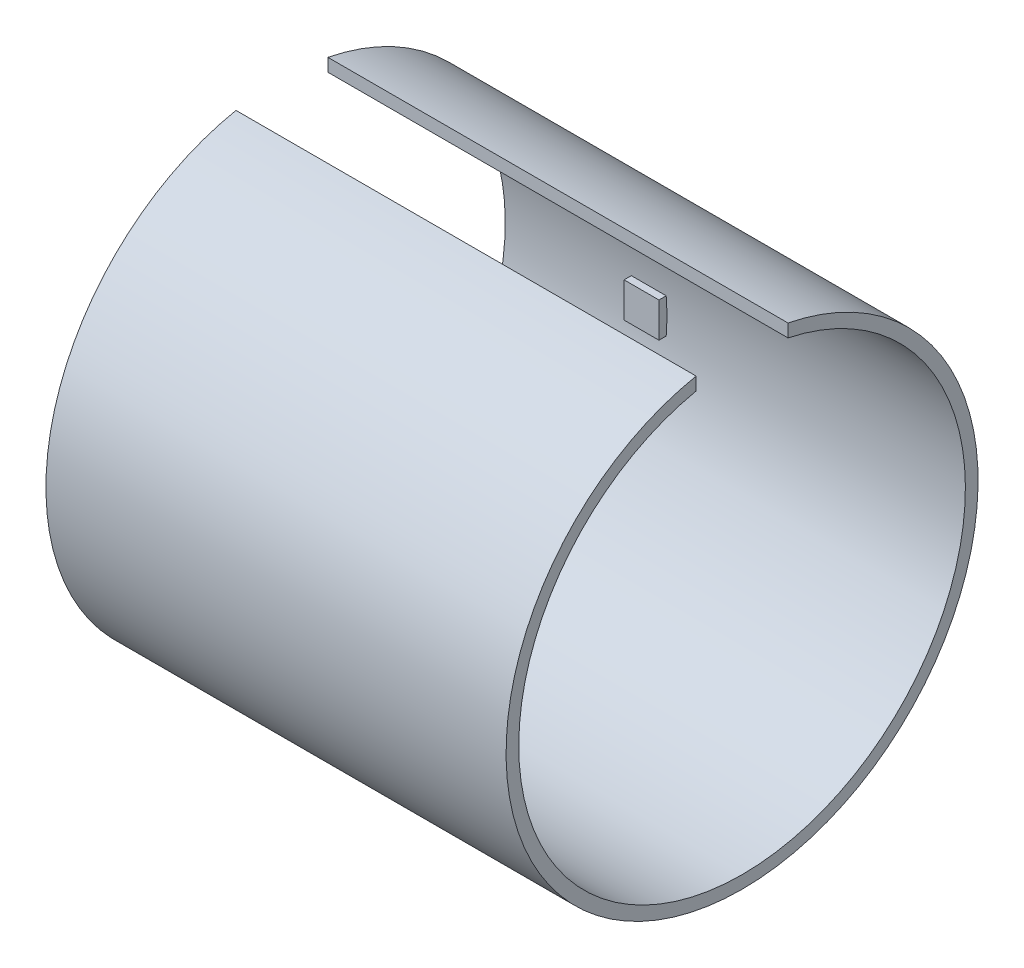
ISO-10303-21;
HEADER;
FILE_DESCRIPTION(('STEP AP214'),'2;1');
FILE_NAME('part.step','',(''),(''),'','','');
FILE_SCHEMA(('AUTOMOTIVE_DESIGN { 1 0 10303 214 1 1 1 1 }'));
ENDSEC;
DATA;
#1=APPLICATION_CONTEXT('core data for automotive mechanical design processes');
#2=APPLICATION_PROTOCOL_DEFINITION('international standard','automotive_design',2000,#1);
#3=PRODUCT_CONTEXT('',#1,'mechanical');
#4=PRODUCT('Part','Part','',(#3));
#5=PRODUCT_RELATED_PRODUCT_CATEGORY('part','',(#4));
#6=PRODUCT_DEFINITION_FORMATION('','',#4);
#7=PRODUCT_DEFINITION_CONTEXT('part definition',#1,'design');
#8=PRODUCT_DEFINITION('design','',#6,#7);
#9=PRODUCT_DEFINITION_SHAPE('','',#8);
#10=(LENGTH_UNIT() NAMED_UNIT(*) SI_UNIT(.MILLI.,.METRE.));
#11=(NAMED_UNIT(*) PLANE_ANGLE_UNIT() SI_UNIT($,.RADIAN.));
#12=(NAMED_UNIT(*) SI_UNIT($,.STERADIAN.) SOLID_ANGLE_UNIT());
#13=UNCERTAINTY_MEASURE_WITH_UNIT(LENGTH_MEASURE(1.E-05),#10,'distance_accuracy_value','');
#14=(GEOMETRIC_REPRESENTATION_CONTEXT(3) GLOBAL_UNCERTAINTY_ASSIGNED_CONTEXT((#13)) GLOBAL_UNIT_ASSIGNED_CONTEXT((#10,
#11,#12)) REPRESENTATION_CONTEXT('',''));
#15=CARTESIAN_POINT('',(0.,0.,0.));
#16=DIRECTION('',(0.,0.,1.));
#17=DIRECTION('',(1.,0.,0.));
#18=AXIS2_PLACEMENT_3D('',#15,#16,#17);
#19=CARTESIAN_POINT('',(10.16,1.397,-17.265000014));
#20=DIRECTION('',(1.,0.,0.));
#21=DIRECTION('',(0.,0.,-1.));
#22=AXIS2_PLACEMENT_3D('',#19,#20,#21);
#23=PLANE('',#22);
#24=CARTESIAN_POINT('',(10.16,0.,0.));
#25=DIRECTION('',(-1.,0.,0.));
#26=DIRECTION('',(0.,0.,1.));
#27=AXIS2_PLACEMENT_3D('',#24,#25,#26);
#28=CIRCLE('',#27,17.9);
#29=CARTESIAN_POINT('',(10.16,-1.397,-17.8454025171751));
#30=VERTEX_POINT('',#29);
#31=CARTESIAN_POINT('',(10.16,1.397,-17.8454025171751));
#32=VERTEX_POINT('',#31);
#33=EDGE_CURVE('E20',#30,#32,#28,.F.);
#34=ORIENTED_EDGE('',*,*,#33,.F.);
#35=DIRECTION('',(0.,0.,-1.));
#36=VECTOR('',#35,1.);
#37=CARTESIAN_POINT('',(10.16,-1.397,-17.265000014));
#38=LINE('',#37,#36);
#39=CARTESIAN_POINT('',(10.16,-1.397,-17.265000014));
#40=VERTEX_POINT('',#39);
#41=EDGE_CURVE('E106',#40,#30,#38,.T.);
#42=ORIENTED_EDGE('',*,*,#41,.F.);
#43=DIRECTION('',(0.,1.,0.));
#44=VECTOR('',#43,1.);
#45=CARTESIAN_POINT('',(10.16,-1.397,-17.265000014));
#46=LINE('',#45,#44);
#47=CARTESIAN_POINT('',(10.16,1.397,-17.265000014));
#48=VERTEX_POINT('',#47);
#49=EDGE_CURVE('E138',#48,#40,#46,.F.);
#50=ORIENTED_EDGE('',*,*,#49,.F.);
#51=DIRECTION('',(0.,0.,-1.));
#52=VECTOR('',#51,1.);
#53=CARTESIAN_POINT('',(10.16,1.397,-17.265000014));
#54=LINE('',#53,#52);
#55=EDGE_CURVE('E108',#32,#48,#54,.F.);
#56=ORIENTED_EDGE('',*,*,#55,.F.);
#57=EDGE_LOOP('',(#34,#42,#50,#56));
#58=FACE_BOUND('',#57,.T.);
#59=ADVANCED_FACE('F17',(#58),#23,.F.);
#60=CARTESIAN_POINT('',(12.954,-1.397,-17.265000014));
#61=DIRECTION('',(-1.,0.,0.));
#62=DIRECTION('',(0.,0.,1.));
#63=AXIS2_PLACEMENT_3D('',#60,#61,#62);
#64=PLANE('',#63);
#65=CARTESIAN_POINT('',(12.954,0.,0.));
#66=DIRECTION('',(-1.,0.,0.));
#67=DIRECTION('',(0.,0.,1.));
#68=AXIS2_PLACEMENT_3D('',#65,#66,#67);
#69=CIRCLE('',#68,17.9);
#70=CARTESIAN_POINT('',(12.954,1.397,-17.8454025171751));
#71=VERTEX_POINT('',#70);
#72=CARTESIAN_POINT('',(12.954,-1.397,-17.8454025171751));
#73=VERTEX_POINT('',#72);
#74=EDGE_CURVE('E121',#71,#73,#69,.T.);
#75=ORIENTED_EDGE('',*,*,#74,.F.);
#76=DIRECTION('',(0.,0.,1.));
#77=VECTOR('',#76,1.);
#78=CARTESIAN_POINT('',(12.954,1.397,-17.265000014));
#79=LINE('',#78,#77);
#80=CARTESIAN_POINT('',(12.954,1.397,-17.265000014));
#81=VERTEX_POINT('',#80);
#82=EDGE_CURVE('E109',#81,#71,#79,.F.);
#83=ORIENTED_EDGE('',*,*,#82,.F.);
#84=DIRECTION('',(0.,1.,0.));
#85=VECTOR('',#84,1.);
#86=CARTESIAN_POINT('',(12.954,-1.397,-17.265000014));
#87=LINE('',#86,#85);
#88=CARTESIAN_POINT('',(12.954,-1.397,-17.265000014));
#89=VERTEX_POINT('',#88);
#90=EDGE_CURVE('E134',#89,#81,#87,.T.);
#91=ORIENTED_EDGE('',*,*,#90,.F.);
#92=DIRECTION('',(0.,0.,1.));
#93=VECTOR('',#92,1.);
#94=CARTESIAN_POINT('',(12.954,-1.397,-17.265000014));
#95=LINE('',#94,#93);
#96=EDGE_CURVE('E150',#73,#89,#95,.T.);
#97=ORIENTED_EDGE('',*,*,#96,.F.);
#98=EDGE_LOOP('',(#75,#83,#91,#97));
#99=FACE_BOUND('',#98,.T.);
#100=ADVANCED_FACE('F186',(#99),#64,.F.);
#101=CARTESIAN_POINT('',(10.16,-1.397,-17.265000014));
#102=DIRECTION('',(0.,0.,1.));
#103=DIRECTION('',(1.,0.,0.));
#104=AXIS2_PLACEMENT_3D('',#101,#102,#103);
#105=PLANE('',#104);
#106=ORIENTED_EDGE('',*,*,#90,.T.);
#107=DIRECTION('',(1.,0.,0.));
#108=VECTOR('',#107,1.);
#109=CARTESIAN_POINT('',(12.954,1.397,-17.265000014));
#110=LINE('',#109,#108);
#111=EDGE_CURVE('E137',#81,#48,#110,.F.);
#112=ORIENTED_EDGE('',*,*,#111,.T.);
#113=ORIENTED_EDGE('',*,*,#49,.T.);
#114=DIRECTION('',(-1.,0.,0.));
#115=VECTOR('',#114,1.);
#116=CARTESIAN_POINT('',(10.16,-1.397,-17.265000014));
#117=LINE('',#116,#115);
#118=EDGE_CURVE('E117',#40,#89,#117,.F.);
#119=ORIENTED_EDGE('',*,*,#118,.T.);
#120=EDGE_LOOP('',(#106,#112,#113,#119));
#121=FACE_BOUND('',#120,.T.);
#122=ADVANCED_FACE('F183',(#121),#105,.T.);
#123=CARTESIAN_POINT('',(12.954,1.397,-17.265000014));
#124=DIRECTION('',(0.,-1.,0.));
#125=DIRECTION('',(1.,0.,0.));
#126=AXIS2_PLACEMENT_3D('',#123,#124,#125);
#127=PLANE('',#126);
#128=DIRECTION('',(-1.,0.,0.));
#129=VECTOR('',#128,1.);
#130=CARTESIAN_POINT('',(36.8808,1.397,-17.8454025171751));
#131=LINE('',#130,#129);
#132=EDGE_CURVE('E123',#71,#32,#131,.T.);
#133=ORIENTED_EDGE('',*,*,#132,.T.);
#134=ORIENTED_EDGE('',*,*,#55,.T.);
#135=ORIENTED_EDGE('',*,*,#111,.F.);
#136=ORIENTED_EDGE('',*,*,#82,.T.);
#137=EDGE_LOOP('',(#133,#134,#135,#136));
#138=FACE_BOUND('',#137,.T.);
#139=ADVANCED_FACE('F181',(#138),#127,.F.);
#140=CARTESIAN_POINT('',(10.16,-1.397,-17.265000014));
#141=DIRECTION('',(0.,1.,0.));
#142=DIRECTION('',(-1.,0.,0.));
#143=AXIS2_PLACEMENT_3D('',#140,#141,#142);
#144=PLANE('',#143);
#145=DIRECTION('',(-1.,0.,0.));
#146=VECTOR('',#145,1.);
#147=CARTESIAN_POINT('',(36.8808,-1.397,-17.8454025171751));
#148=LINE('',#147,#146);
#149=EDGE_CURVE('E114',#30,#73,#148,.F.);
#150=ORIENTED_EDGE('',*,*,#149,.T.);
#151=ORIENTED_EDGE('',*,*,#96,.T.);
#152=ORIENTED_EDGE('',*,*,#118,.F.);
#153=ORIENTED_EDGE('',*,*,#41,.T.);
#154=EDGE_LOOP('',(#150,#151,#152,#153));
#155=FACE_BOUND('',#154,.T.);
#156=ADVANCED_FACE('F113',(#155),#144,.F.);
#157=CARTESIAN_POINT('',(12.954,-1.397,-18.281000014));
#158=DIRECTION('',(-1.,0.,0.));
#159=DIRECTION('',(0.,0.,1.));
#160=AXIS2_PLACEMENT_3D('',#157,#158,#159);
#161=PLANE('',#160);
#162=DIRECTION('',(0.,0.,1.));
#163=VECTOR('',#162,1.);
#164=CARTESIAN_POINT('',(12.954,-1.397,-18.281000014));
#165=LINE('',#164,#163);
#166=CARTESIAN_POINT('',(12.954,-1.397,-18.8643432697775));
#167=VERTEX_POINT('',#166);
#168=CARTESIAN_POINT('',(12.954,-1.397,-18.281000014));
#169=VERTEX_POINT('',#168);
#170=EDGE_CURVE('E35',#167,#169,#165,.T.);
#171=ORIENTED_EDGE('',*,*,#170,.T.);
#172=DIRECTION('',(0.,1.,0.));
#173=VECTOR('',#172,1.);
#174=CARTESIAN_POINT('',(12.954,1.397,-18.281000014));
#175=LINE('',#174,#173);
#176=CARTESIAN_POINT('',(12.954,1.397,-18.281000014));
#177=VERTEX_POINT('',#176);
#178=EDGE_CURVE('E382',#177,#169,#175,.F.);
#179=ORIENTED_EDGE('',*,*,#178,.F.);
#180=DIRECTION('',(0.,0.,1.));
#181=VECTOR('',#180,1.);
#182=CARTESIAN_POINT('',(12.954,1.397,-18.281000014));
#183=LINE('',#182,#181);
#184=CARTESIAN_POINT('',(12.954,1.397,-18.8643432697775));
#185=VERTEX_POINT('',#184);
#186=EDGE_CURVE('E126',#185,#177,#183,.T.);
#187=ORIENTED_EDGE('',*,*,#186,.F.);
#188=CARTESIAN_POINT('',(12.954,0.,0.));
#189=DIRECTION('',(-1.,0.,0.));
#190=DIRECTION('',(0.,0.,1.));
#191=AXIS2_PLACEMENT_3D('',#188,#189,#190);
#192=CIRCLE('',#191,18.916);
#193=EDGE_CURVE('E142',#185,#167,#192,.T.);
#194=ORIENTED_EDGE('',*,*,#193,.T.);
#195=EDGE_LOOP('',(#171,#179,#187,#194));
#196=FACE_BOUND('',#195,.T.);
#197=ADVANCED_FACE('F236',(#196),#161,.T.);
#198=CARTESIAN_POINT('',(10.16,-1.397,-18.281000014));
#199=DIRECTION('',(1.,0.,0.));
#200=DIRECTION('',(0.,0.,-1.));
#201=AXIS2_PLACEMENT_3D('',#198,#199,#200);
#202=PLANE('',#201);
#203=DIRECTION('',(0.,1.,0.));
#204=VECTOR('',#203,1.);
#205=CARTESIAN_POINT('',(10.16,1.397,-18.281000014));
#206=LINE('',#205,#204);
#207=CARTESIAN_POINT('',(10.16,-1.397,-18.281000014));
#208=VERTEX_POINT('',#207);
#209=CARTESIAN_POINT('',(10.16,1.397,-18.281000014));
#210=VERTEX_POINT('',#209);
#211=EDGE_CURVE('E375',#208,#210,#206,.T.);
#212=ORIENTED_EDGE('',*,*,#211,.F.);
#213=DIRECTION('',(0.,0.,-1.));
#214=VECTOR('',#213,1.);
#215=CARTESIAN_POINT('',(10.16,-1.397,-18.281000014));
#216=LINE('',#215,#214);
#217=CARTESIAN_POINT('',(10.16,-1.397,-18.8643432697775));
#218=VERTEX_POINT('',#217);
#219=EDGE_CURVE('E169',#208,#218,#216,.T.);
#220=ORIENTED_EDGE('',*,*,#219,.T.);
#221=CARTESIAN_POINT('',(10.16,0.,0.));
#222=DIRECTION('',(-1.,0.,0.));
#223=DIRECTION('',(0.,0.,1.));
#224=AXIS2_PLACEMENT_3D('',#221,#222,#223);
#225=CIRCLE('',#224,18.916);
#226=CARTESIAN_POINT('',(10.16,1.397,-18.8643432697775));
#227=VERTEX_POINT('',#226);
#228=EDGE_CURVE('E167',#218,#227,#225,.F.);
#229=ORIENTED_EDGE('',*,*,#228,.T.);
#230=DIRECTION('',(0.,0.,1.));
#231=VECTOR('',#230,1.);
#232=CARTESIAN_POINT('',(10.16,1.397,-18.281000014));
#233=LINE('',#232,#231);
#234=EDGE_CURVE('E378',#210,#227,#233,.F.);
#235=ORIENTED_EDGE('',*,*,#234,.F.);
#236=EDGE_LOOP('',(#212,#220,#229,#235));
#237=FACE_BOUND('',#236,.T.);
#238=ADVANCED_FACE('F232',(#237),#202,.T.);
#239=CARTESIAN_POINT('',(36.8808,17.5170063367003,3.683));
#240=DIRECTION('',(0.,0.,1.));
#241=DIRECTION('',(1.,0.,0.));
#242=AXIS2_PLACEMENT_3D('',#239,#240,#241);
#243=PLANE('',#242);
#244=DIRECTION('',(-1.,0.,0.));
#245=VECTOR('',#244,1.);
#246=CARTESIAN_POINT('',(36.8808,18.5539905950176,3.683));
#247=LINE('',#246,#245);
#248=CARTESIAN_POINT('',(36.8808,18.5539905950176,3.683));
#249=VERTEX_POINT('',#248);
#250=CARTESIAN_POINT('',(0.,18.5539905950176,3.683));
#251=VERTEX_POINT('',#250);
#252=EDGE_CURVE('E418',#249,#251,#247,.T.);
#253=ORIENTED_EDGE('',*,*,#252,.F.);
#254=DIRECTION('',(0.,1.,0.));
#255=VECTOR('',#254,1.);
#256=CARTESIAN_POINT('',(36.8808,0.,3.683));
#257=LINE('',#256,#255);
#258=CARTESIAN_POINT('',(36.8808,17.5170063367003,3.683));
#259=VERTEX_POINT('',#258);
#260=EDGE_CURVE('E165',#259,#249,#257,.T.);
#261=ORIENTED_EDGE('',*,*,#260,.F.);
#262=DIRECTION('',(-1.,0.,0.));
#263=VECTOR('',#262,1.);
#264=CARTESIAN_POINT('',(36.8808,17.5170063367003,3.683));
#265=LINE('',#264,#263);
#266=CARTESIAN_POINT('',(0.,17.5170063367003,3.683));
#267=VERTEX_POINT('',#266);
#268=EDGE_CURVE('E122',#259,#267,#265,.T.);
#269=ORIENTED_EDGE('',*,*,#268,.T.);
#270=DIRECTION('',(0.,1.,0.));
#271=VECTOR('',#270,1.);
#272=CARTESIAN_POINT('',(0.,17.5170063367003,3.683));
#273=LINE('',#272,#271);
#274=EDGE_CURVE('E128',#251,#267,#273,.F.);
#275=ORIENTED_EDGE('',*,*,#274,.F.);
#276=EDGE_LOOP('',(#253,#261,#269,#275));
#277=FACE_BOUND('',#276,.T.);
#278=ADVANCED_FACE('F229',(#277),#243,.F.);
#279=CARTESIAN_POINT('',(36.8808,0.,0.));
#280=DIRECTION('',(-1.,0.,0.));
#281=DIRECTION('',(0.,0.,1.));
#282=AXIS2_PLACEMENT_3D('',#279,#280,#281);
#283=CYLINDRICAL_SURFACE('',#282,17.9);
#284=ORIENTED_EDGE('',*,*,#149,.F.);
#285=ORIENTED_EDGE('',*,*,#33,.T.);
#286=ORIENTED_EDGE('',*,*,#132,.F.);
#287=ORIENTED_EDGE('',*,*,#74,.T.);
#288=EDGE_LOOP('',(#284,#285,#286,#287));
#289=FACE_BOUND('',#288,.T.);
#290=CARTESIAN_POINT('',(36.8808,0.,0.));
#291=DIRECTION('',(-1.,0.,0.));
#292=DIRECTION('',(0.,0.,1.));
#293=AXIS2_PLACEMENT_3D('',#290,#291,#292);
#294=CIRCLE('',#293,17.9);
#295=CARTESIAN_POINT('',(36.8808,17.5170063367003,-3.683));
#296=VERTEX_POINT('',#295);
#297=EDGE_CURVE('E162',#296,#259,#294,.T.);
#298=ORIENTED_EDGE('',*,*,#297,.F.);
#299=DIRECTION('',(-1.,0.,0.));
#300=VECTOR('',#299,1.);
#301=CARTESIAN_POINT('',(36.8808,17.5170063367003,-3.683));
#302=LINE('',#301,#300);
#303=CARTESIAN_POINT('',(0.,17.5170063367003,-3.683));
#304=VERTEX_POINT('',#303);
#305=EDGE_CURVE('E394',#296,#304,#302,.T.);
#306=ORIENTED_EDGE('',*,*,#305,.T.);
#307=CARTESIAN_POINT('',(0.,0.,0.));
#308=DIRECTION('',(-1.,0.,0.));
#309=DIRECTION('',(0.,0.,1.));
#310=AXIS2_PLACEMENT_3D('',#307,#308,#309);
#311=CIRCLE('',#310,17.9);
#312=EDGE_CURVE('E157',#304,#267,#311,.T.);
#313=ORIENTED_EDGE('',*,*,#312,.T.);
#314=ORIENTED_EDGE('',*,*,#268,.F.);
#315=EDGE_LOOP('',(#298,#306,#313,#314));
#316=FACE_BOUND('',#315,.T.);
#317=ADVANCED_FACE('F119',(#289,#316),#283,.F.);
#318=CARTESIAN_POINT('',(10.16,1.397,-18.281000014));
#319=DIRECTION('',(0.,-1.,0.));
#320=DIRECTION('',(1.,0.,0.));
#321=AXIS2_PLACEMENT_3D('',#318,#319,#320);
#322=PLANE('',#321);
#323=DIRECTION('',(-1.,0.,0.));
#324=VECTOR('',#323,1.);
#325=CARTESIAN_POINT('',(12.954,1.397,-18.281000014));
#326=LINE('',#325,#324);
#327=EDGE_CURVE('E381',#210,#177,#326,.F.);
#328=ORIENTED_EDGE('',*,*,#327,.F.);
#329=ORIENTED_EDGE('',*,*,#234,.T.);
#330=DIRECTION('',(-1.,0.,0.));
#331=VECTOR('',#330,1.);
#332=CARTESIAN_POINT('',(36.8808,1.397,-18.8643432697775));
#333=LINE('',#332,#331);
#334=EDGE_CURVE('E160',#185,#227,#333,.T.);
#335=ORIENTED_EDGE('',*,*,#334,.F.);
#336=ORIENTED_EDGE('',*,*,#186,.T.);
#337=EDGE_LOOP('',(#328,#329,#335,#336));
#338=FACE_BOUND('',#337,.T.);
#339=ADVANCED_FACE('F222',(#338),#322,.T.);
#340=CARTESIAN_POINT('',(36.8808,17.5170063367003,-3.683));
#341=DIRECTION('',(0.,0.,-1.));
#342=DIRECTION('',(-1.,0.,0.));
#343=AXIS2_PLACEMENT_3D('',#340,#341,#342);
#344=PLANE('',#343);
#345=ORIENTED_EDGE('',*,*,#305,.F.);
#346=DIRECTION('',(0.,1.,0.));
#347=VECTOR('',#346,1.);
#348=CARTESIAN_POINT('',(36.8808,0.,-3.683));
#349=LINE('',#348,#347);
#350=CARTESIAN_POINT('',(36.8808,18.5539905950176,-3.683));
#351=VERTEX_POINT('',#350);
#352=EDGE_CURVE('E166',#351,#296,#349,.F.);
#353=ORIENTED_EDGE('',*,*,#352,.F.);
#354=DIRECTION('',(-1.,0.,0.));
#355=VECTOR('',#354,1.);
#356=CARTESIAN_POINT('',(36.8808,18.5539905950176,-3.683));
#357=LINE('',#356,#355);
#358=CARTESIAN_POINT('',(0.,18.5539905950176,-3.683));
#359=VERTEX_POINT('',#358);
#360=EDGE_CURVE('E385',#359,#351,#357,.F.);
#361=ORIENTED_EDGE('',*,*,#360,.F.);
#362=DIRECTION('',(0.,1.,0.));
#363=VECTOR('',#362,1.);
#364=CARTESIAN_POINT('',(0.,0.,-3.683));
#365=LINE('',#364,#363);
#366=EDGE_CURVE('E161',#359,#304,#365,.F.);
#367=ORIENTED_EDGE('',*,*,#366,.T.);
#368=EDGE_LOOP('',(#345,#353,#361,#367));
#369=FACE_BOUND('',#368,.T.);
#370=ADVANCED_FACE('F218',(#369),#344,.F.);
#371=CARTESIAN_POINT('',(12.954,1.397,-18.281000014));
#372=DIRECTION('',(0.,0.,-1.));
#373=DIRECTION('',(-1.,0.,0.));
#374=AXIS2_PLACEMENT_3D('',#371,#372,#373);
#375=PLANE('',#374);
#376=ORIENTED_EDGE('',*,*,#211,.T.);
#377=ORIENTED_EDGE('',*,*,#327,.T.);
#378=ORIENTED_EDGE('',*,*,#178,.T.);
#379=DIRECTION('',(-1.,0.,0.));
#380=VECTOR('',#379,1.);
#381=CARTESIAN_POINT('',(10.16,-1.397,-18.281000014));
#382=LINE('',#381,#380);
#383=EDGE_CURVE('E156',#208,#169,#382,.F.);
#384=ORIENTED_EDGE('',*,*,#383,.F.);
#385=EDGE_LOOP('',(#376,#377,#378,#384));
#386=FACE_BOUND('',#385,.T.);
#387=ADVANCED_FACE('F214',(#386),#375,.T.);
#388=CARTESIAN_POINT('',(36.8808,0.,0.));
#389=DIRECTION('',(1.,0.,0.));
#390=DIRECTION('',(0.,0.,-1.));
#391=AXIS2_PLACEMENT_3D('',#388,#389,#390);
#392=PLANE('',#391);
#393=ORIENTED_EDGE('',*,*,#297,.T.);
#394=ORIENTED_EDGE('',*,*,#260,.T.);
#395=CARTESIAN_POINT('',(36.8808,0.,0.));
#396=DIRECTION('',(-1.,0.,0.));
#397=DIRECTION('',(0.,0.,1.));
#398=AXIS2_PLACEMENT_3D('',#395,#396,#397);
#399=CIRCLE('',#398,18.916);
#400=EDGE_CURVE('E154',#351,#249,#399,.T.);
#401=ORIENTED_EDGE('',*,*,#400,.F.);
#402=ORIENTED_EDGE('',*,*,#352,.T.);
#403=EDGE_LOOP('',(#393,#394,#401,#402));
#404=FACE_BOUND('',#403,.T.);
#405=ADVANCED_FACE('F210',(#404),#392,.T.);
#406=CARTESIAN_POINT('',(0.,0.,0.));
#407=DIRECTION('',(1.,0.,0.));
#408=DIRECTION('',(0.,0.,-1.));
#409=AXIS2_PLACEMENT_3D('',#406,#407,#408);
#410=PLANE('',#409);
#411=ORIENTED_EDGE('',*,*,#274,.T.);
#412=ORIENTED_EDGE('',*,*,#312,.F.);
#413=ORIENTED_EDGE('',*,*,#366,.F.);
#414=CARTESIAN_POINT('',(0.,0.,0.));
#415=DIRECTION('',(-1.,0.,0.));
#416=DIRECTION('',(0.,0.,1.));
#417=AXIS2_PLACEMENT_3D('',#414,#415,#416);
#418=CIRCLE('',#417,18.916);
#419=EDGE_CURVE('E26',#251,#359,#418,.F.);
#420=ORIENTED_EDGE('',*,*,#419,.F.);
#421=EDGE_LOOP('',(#411,#412,#413,#420));
#422=FACE_BOUND('',#421,.T.);
#423=ADVANCED_FACE('F202',(#422),#410,.F.);
#424=CARTESIAN_POINT('',(10.16,-1.397,-18.281000014));
#425=DIRECTION('',(0.,1.,0.));
#426=DIRECTION('',(-1.,0.,0.));
#427=AXIS2_PLACEMENT_3D('',#424,#425,#426);
#428=PLANE('',#427);
#429=ORIENTED_EDGE('',*,*,#383,.T.);
#430=ORIENTED_EDGE('',*,*,#170,.F.);
#431=DIRECTION('',(-1.,0.,0.));
#432=VECTOR('',#431,1.);
#433=CARTESIAN_POINT('',(36.8808,-1.397,-18.8643432697775));
#434=LINE('',#433,#432);
#435=EDGE_CURVE('E11',#218,#167,#434,.F.);
#436=ORIENTED_EDGE('',*,*,#435,.F.);
#437=ORIENTED_EDGE('',*,*,#219,.F.);
#438=EDGE_LOOP('',(#429,#430,#436,#437));
#439=FACE_BOUND('',#438,.T.);
#440=ADVANCED_FACE('F196',(#439),#428,.T.);
#441=CARTESIAN_POINT('',(36.8808,0.,0.));
#442=DIRECTION('',(-1.,0.,0.));
#443=DIRECTION('',(0.,0.,1.));
#444=AXIS2_PLACEMENT_3D('',#441,#442,#443);
#445=CYLINDRICAL_SURFACE('',#444,18.916);
#446=ORIENTED_EDGE('',*,*,#360,.T.);
#447=ORIENTED_EDGE('',*,*,#400,.T.);
#448=ORIENTED_EDGE('',*,*,#252,.T.);
#449=ORIENTED_EDGE('',*,*,#419,.T.);
#450=EDGE_LOOP('',(#446,#447,#448,#449));
#451=FACE_BOUND('',#450,.T.);
#452=ORIENTED_EDGE('',*,*,#435,.T.);
#453=ORIENTED_EDGE('',*,*,#193,.F.);
#454=ORIENTED_EDGE('',*,*,#334,.T.);
#455=ORIENTED_EDGE('',*,*,#228,.F.);
#456=EDGE_LOOP('',(#452,#453,#454,#455));
#457=FACE_BOUND('',#456,.T.);
#458=ADVANCED_FACE('F194',(#451,#457),#445,.T.);
#459=CLOSED_SHELL('',(#59,#100,#122,#139,#156,#197,#238,#278,#317,#339,#370,#387,#405,#423,#440,#458));
#460=MANIFOLD_SOLID_BREP('B1',#459);
#461=ADVANCED_BREP_SHAPE_REPRESENTATION('',(#18,#460),#14);
#462=SHAPE_DEFINITION_REPRESENTATION(#9,#461);
ENDSEC;
END-ISO-10303-21;
